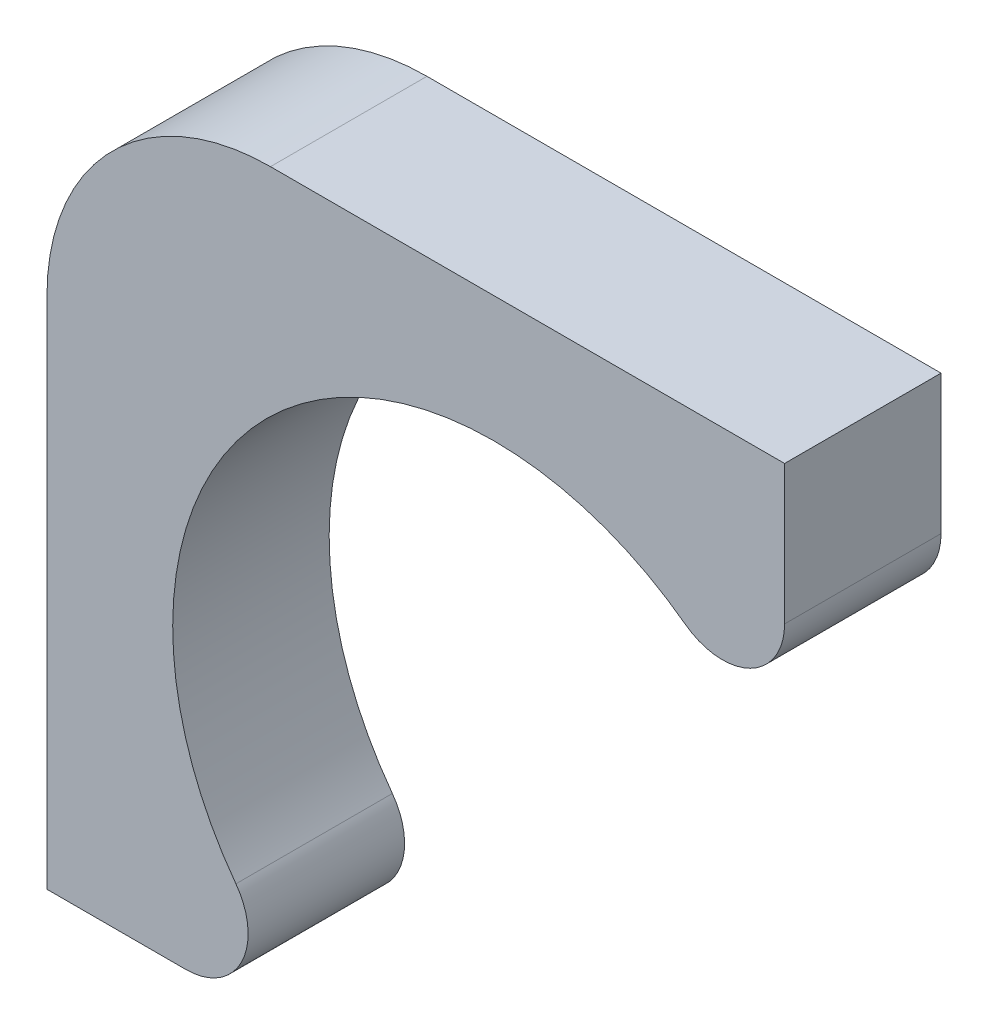
ISO-10303-21;
HEADER;
FILE_DESCRIPTION(('STEP AP214'),'2;1');
FILE_NAME('part.step','',(''),(''),'','','');
FILE_SCHEMA(('AUTOMOTIVE_DESIGN { 1 0 10303 214 1 1 1 1 }'));
ENDSEC;
DATA;
#1=APPLICATION_CONTEXT('core data for automotive mechanical design processes');
#2=APPLICATION_PROTOCOL_DEFINITION('international standard','automotive_design',2000,#1);
#3=PRODUCT_CONTEXT('',#1,'mechanical');
#4=PRODUCT('Part','Part','',(#3));
#5=PRODUCT_RELATED_PRODUCT_CATEGORY('part','',(#4));
#6=PRODUCT_DEFINITION_FORMATION('','',#4);
#7=PRODUCT_DEFINITION_CONTEXT('part definition',#1,'design');
#8=PRODUCT_DEFINITION('design','',#6,#7);
#9=PRODUCT_DEFINITION_SHAPE('','',#8);
#10=(LENGTH_UNIT() NAMED_UNIT(*) SI_UNIT(.MILLI.,.METRE.));
#11=(NAMED_UNIT(*) PLANE_ANGLE_UNIT() SI_UNIT($,.RADIAN.));
#12=(NAMED_UNIT(*) SI_UNIT($,.STERADIAN.) SOLID_ANGLE_UNIT());
#13=UNCERTAINTY_MEASURE_WITH_UNIT(LENGTH_MEASURE(1.E-05),#10,'distance_accuracy_value','');
#14=(GEOMETRIC_REPRESENTATION_CONTEXT(3) GLOBAL_UNCERTAINTY_ASSIGNED_CONTEXT((#13)) GLOBAL_UNIT_ASSIGNED_CONTEXT((#10,
#11,#12)) REPRESENTATION_CONTEXT('',''));
#15=CARTESIAN_POINT('',(0.,0.,0.));
#16=DIRECTION('',(0.,0.,1.));
#17=DIRECTION('',(1.,0.,0.));
#18=AXIS2_PLACEMENT_3D('',#15,#16,#17);
#19=CARTESIAN_POINT('',(-2.75631465594122,-2.04368534405878,1.4));
#20=DIRECTION('',(0.,0.,-1.));
#21=DIRECTION('',(-1.,0.,0.));
#22=AXIS2_PLACEMENT_3D('',#19,#20,#21);
#23=CYLINDRICAL_SURFACE('',#22,0.556314655941221);
#24=CARTESIAN_POINT('',(-2.75631465594122,-2.04368534405878,0.));
#25=DIRECTION('',(0.,0.,1.));
#26=DIRECTION('',(1.,0.,0.));
#27=AXIS2_PLACEMENT_3D('',#24,#25,#26);
#28=CIRCLE('',#27,0.556314655941221);
#29=CARTESIAN_POINT('',(-2.75631465594122,-2.6,0.));
#30=VERTEX_POINT('',#29);
#31=CARTESIAN_POINT('',(-2.30943688656187,-1.7123452534426,0.));
#32=VERTEX_POINT('',#31);
#33=EDGE_CURVE('E133',#30,#32,#28,.T.);
#34=ORIENTED_EDGE('',*,*,#33,.T.);
#35=DIRECTION('',(0.,0.,-1.));
#36=VECTOR('',#35,1.);
#37=CARTESIAN_POINT('',(-2.30943688656187,-1.7123452534426,1.4));
#38=LINE('',#37,#36);
#39=CARTESIAN_POINT('',(-2.30943688656187,-1.7123452534426,1.4));
#40=VERTEX_POINT('',#39);
#41=EDGE_CURVE('E11',#40,#32,#38,.T.);
#42=ORIENTED_EDGE('',*,*,#41,.F.);
#43=CARTESIAN_POINT('',(-2.75631465594122,-2.04368534405878,1.4));
#44=DIRECTION('',(0.,0.,1.));
#45=DIRECTION('',(1.,0.,0.));
#46=AXIS2_PLACEMENT_3D('',#43,#44,#45);
#47=CIRCLE('',#46,0.556314655941221);
#48=CARTESIAN_POINT('',(-2.75631465594122,-2.6,1.4));
#49=VERTEX_POINT('',#48);
#50=EDGE_CURVE('E147',#49,#40,#47,.T.);
#51=ORIENTED_EDGE('',*,*,#50,.F.);
#52=DIRECTION('',(0.,0.,-1.));
#53=VECTOR('',#52,1.);
#54=CARTESIAN_POINT('',(-2.75631465594122,-2.6,1.4));
#55=LINE('',#54,#53);
#56=EDGE_CURVE('E129',#49,#30,#55,.T.);
#57=ORIENTED_EDGE('',*,*,#56,.T.);
#58=EDGE_LOOP('',(#34,#42,#51,#57));
#59=FACE_BOUND('',#58,.T.);
#60=ADVANCED_FACE('F37',(#59),#23,.T.);
#61=CARTESIAN_POINT('',(0.,0.,1.4));
#62=DIRECTION('',(0.,0.,-1.));
#63=DIRECTION('',(-1.,0.,0.));
#64=AXIS2_PLACEMENT_3D('',#61,#62,#63);
#65=CYLINDRICAL_SURFACE('',#64,2.875);
#66=CARTESIAN_POINT('',(0.,0.,0.));
#67=DIRECTION('',(0.,0.,-1.));
#68=DIRECTION('',(-1.,0.,0.));
#69=AXIS2_PLACEMENT_3D('',#66,#67,#68);
#70=CIRCLE('',#69,2.875);
#71=CARTESIAN_POINT('',(1.7123452534426,2.30943688656187,0.));
#72=VERTEX_POINT('',#71);
#73=EDGE_CURVE('E136',#32,#72,#70,.T.);
#74=ORIENTED_EDGE('',*,*,#73,.T.);
#75=DIRECTION('',(0.,0.,-1.));
#76=VECTOR('',#75,1.);
#77=CARTESIAN_POINT('',(1.7123452534426,2.30943688656187,1.4));
#78=LINE('',#77,#76);
#79=CARTESIAN_POINT('',(1.7123452534426,2.30943688656187,1.4));
#80=VERTEX_POINT('',#79);
#81=EDGE_CURVE('E45',#80,#72,#78,.T.);
#82=ORIENTED_EDGE('',*,*,#81,.F.);
#83=CARTESIAN_POINT('',(0.,0.,1.4));
#84=DIRECTION('',(0.,0.,-1.));
#85=DIRECTION('',(-1.,0.,0.));
#86=AXIS2_PLACEMENT_3D('',#83,#84,#85);
#87=CIRCLE('',#86,2.875);
#88=EDGE_CURVE('E96',#40,#80,#87,.T.);
#89=ORIENTED_EDGE('',*,*,#88,.F.);
#90=ORIENTED_EDGE('',*,*,#41,.T.);
#91=EDGE_LOOP('',(#74,#82,#89,#90));
#92=FACE_BOUND('',#91,.T.);
#93=ADVANCED_FACE('F182',(#92),#65,.F.);
#94=CARTESIAN_POINT('',(2.04368534405878,2.75631465594122,1.4));
#95=DIRECTION('',(0.,0.,-1.));
#96=DIRECTION('',(-1.,0.,0.));
#97=AXIS2_PLACEMENT_3D('',#94,#95,#96);
#98=CYLINDRICAL_SURFACE('',#97,0.556314655941221);
#99=CARTESIAN_POINT('',(2.04368534405878,2.75631465594122,0.));
#100=DIRECTION('',(0.,0.,1.));
#101=DIRECTION('',(-1.,0.,0.));
#102=AXIS2_PLACEMENT_3D('',#99,#100,#101);
#103=CIRCLE('',#102,0.556314655941221);
#104=CARTESIAN_POINT('',(2.6,2.75631465594122,0.));
#105=VERTEX_POINT('',#104);
#106=EDGE_CURVE('E138',#72,#105,#103,.T.);
#107=ORIENTED_EDGE('',*,*,#106,.T.);
#108=DIRECTION('',(0.,0.,-1.));
#109=VECTOR('',#108,1.);
#110=CARTESIAN_POINT('',(2.6,2.75631465594122,1.4));
#111=LINE('',#110,#109);
#112=CARTESIAN_POINT('',(2.6,2.75631465594122,1.4));
#113=VERTEX_POINT('',#112);
#114=EDGE_CURVE('E154',#113,#105,#111,.T.);
#115=ORIENTED_EDGE('',*,*,#114,.F.);
#116=CARTESIAN_POINT('',(2.04368534405878,2.75631465594122,1.4));
#117=DIRECTION('',(0.,0.,1.));
#118=DIRECTION('',(-1.,0.,0.));
#119=AXIS2_PLACEMENT_3D('',#116,#117,#118);
#120=CIRCLE('',#119,0.556314655941221);
#121=EDGE_CURVE('E162',#80,#113,#120,.T.);
#122=ORIENTED_EDGE('',*,*,#121,.F.);
#123=ORIENTED_EDGE('',*,*,#81,.T.);
#124=EDGE_LOOP('',(#107,#115,#122,#123));
#125=FACE_BOUND('',#124,.T.);
#126=ADVANCED_FACE('F160',(#125),#98,.T.);
#127=CARTESIAN_POINT('',(2.6,4.,1.4));
#128=DIRECTION('',(-1.,0.,0.));
#129=DIRECTION('',(0.,-1.,0.));
#130=AXIS2_PLACEMENT_3D('',#127,#128,#129);
#131=PLANE('',#130);
#132=DIRECTION('',(0.,1.,0.));
#133=VECTOR('',#132,1.);
#134=CARTESIAN_POINT('',(2.6,4.,0.));
#135=LINE('',#134,#133);
#136=CARTESIAN_POINT('',(2.6,4.,0.));
#137=VERTEX_POINT('',#136);
#138=EDGE_CURVE('E140',#105,#137,#135,.T.);
#139=ORIENTED_EDGE('',*,*,#138,.T.);
#140=DIRECTION('',(0.,0.,-1.));
#141=VECTOR('',#140,1.);
#142=CARTESIAN_POINT('',(2.6,4.,1.4));
#143=LINE('',#142,#141);
#144=CARTESIAN_POINT('',(2.6,4.,1.4));
#145=VERTEX_POINT('',#144);
#146=EDGE_CURVE('E151',#145,#137,#143,.T.);
#147=ORIENTED_EDGE('',*,*,#146,.F.);
#148=DIRECTION('',(0.,1.,0.));
#149=VECTOR('',#148,1.);
#150=CARTESIAN_POINT('',(2.6,4.,1.4));
#151=LINE('',#150,#149);
#152=EDGE_CURVE('E174',#113,#145,#151,.T.);
#153=ORIENTED_EDGE('',*,*,#152,.F.);
#154=ORIENTED_EDGE('',*,*,#114,.T.);
#155=EDGE_LOOP('',(#139,#147,#153,#154));
#156=FACE_BOUND('',#155,.T.);
#157=ADVANCED_FACE('F170',(#156),#131,.F.);
#158=CARTESIAN_POINT('',(2.6,4.,1.4));
#159=DIRECTION('',(0.,-1.,0.));
#160=DIRECTION('',(1.,0.,0.));
#161=AXIS2_PLACEMENT_3D('',#158,#159,#160);
#162=PLANE('',#161);
#163=DIRECTION('',(-1.,0.,0.));
#164=VECTOR('',#163,1.);
#165=CARTESIAN_POINT('',(2.6,4.,0.));
#166=LINE('',#165,#164);
#167=CARTESIAN_POINT('',(-1.99999999999999,4.,0.));
#168=VERTEX_POINT('',#167);
#169=EDGE_CURVE('E142',#137,#168,#166,.T.);
#170=ORIENTED_EDGE('',*,*,#169,.T.);
#171=DIRECTION('',(0.,0.,-1.));
#172=VECTOR('',#171,1.);
#173=CARTESIAN_POINT('',(-1.99999999999999,4.,1.4));
#174=LINE('',#173,#172);
#175=CARTESIAN_POINT('',(-1.99999999999999,4.,1.4));
#176=VERTEX_POINT('',#175);
#177=EDGE_CURVE('E124',#176,#168,#174,.T.);
#178=ORIENTED_EDGE('',*,*,#177,.F.);
#179=DIRECTION('',(-1.,0.,0.));
#180=VECTOR('',#179,1.);
#181=CARTESIAN_POINT('',(2.6,4.,1.4));
#182=LINE('',#181,#180);
#183=EDGE_CURVE('E115',#145,#176,#182,.T.);
#184=ORIENTED_EDGE('',*,*,#183,.F.);
#185=ORIENTED_EDGE('',*,*,#146,.T.);
#186=EDGE_LOOP('',(#170,#178,#184,#185));
#187=FACE_BOUND('',#186,.T.);
#188=ADVANCED_FACE('F173',(#187),#162,.F.);
#189=CARTESIAN_POINT('',(-2.,2.,1.4));
#190=DIRECTION('',(0.,0.,-1.));
#191=DIRECTION('',(-1.,0.,0.));
#192=AXIS2_PLACEMENT_3D('',#189,#190,#191);
#193=CYLINDRICAL_SURFACE('',#192,2.);
#194=CARTESIAN_POINT('',(-2.,2.,0.));
#195=DIRECTION('',(0.,0.,1.));
#196=DIRECTION('',(1.,0.,0.));
#197=AXIS2_PLACEMENT_3D('',#194,#195,#196);
#198=CIRCLE('',#197,2.);
#199=CARTESIAN_POINT('',(-4.,1.99999999999999,0.));
#200=VERTEX_POINT('',#199);
#201=EDGE_CURVE('E123',#168,#200,#198,.T.);
#202=ORIENTED_EDGE('',*,*,#201,.T.);
#203=DIRECTION('',(0.,0.,-1.));
#204=VECTOR('',#203,1.);
#205=CARTESIAN_POINT('',(-4.,1.99999999999999,1.4));
#206=LINE('',#205,#204);
#207=CARTESIAN_POINT('',(-4.,1.99999999999999,1.4));
#208=VERTEX_POINT('',#207);
#209=EDGE_CURVE('E120',#208,#200,#206,.T.);
#210=ORIENTED_EDGE('',*,*,#209,.F.);
#211=CARTESIAN_POINT('',(-2.,2.,1.4));
#212=DIRECTION('',(0.,0.,1.));
#213=DIRECTION('',(1.,0.,0.));
#214=AXIS2_PLACEMENT_3D('',#211,#212,#213);
#215=CIRCLE('',#214,2.);
#216=EDGE_CURVE('E109',#176,#208,#215,.T.);
#217=ORIENTED_EDGE('',*,*,#216,.F.);
#218=ORIENTED_EDGE('',*,*,#177,.T.);
#219=EDGE_LOOP('',(#202,#210,#217,#218));
#220=FACE_BOUND('',#219,.T.);
#221=ADVANCED_FACE('F121',(#220),#193,.T.);
#222=CARTESIAN_POINT('',(-4.,1.99999999999998,1.4));
#223=DIRECTION('',(1.,0.,0.));
#224=DIRECTION('',(0.,0.,-1.));
#225=AXIS2_PLACEMENT_3D('',#222,#223,#224);
#226=PLANE('',#225);
#227=DIRECTION('',(0.,-1.,0.));
#228=VECTOR('',#227,1.);
#229=CARTESIAN_POINT('',(-4.,1.99999999999998,0.));
#230=LINE('',#229,#228);
#231=CARTESIAN_POINT('',(-4.,-2.6,0.));
#232=VERTEX_POINT('',#231);
#233=EDGE_CURVE('E82',#200,#232,#230,.T.);
#234=ORIENTED_EDGE('',*,*,#233,.T.);
#235=DIRECTION('',(0.,0.,-1.));
#236=VECTOR('',#235,1.);
#237=CARTESIAN_POINT('',(-4.,-2.6,1.4));
#238=LINE('',#237,#236);
#239=CARTESIAN_POINT('',(-4.,-2.6,1.4));
#240=VERTEX_POINT('',#239);
#241=EDGE_CURVE('E125',#240,#232,#238,.T.);
#242=ORIENTED_EDGE('',*,*,#241,.F.);
#243=DIRECTION('',(0.,-1.,0.));
#244=VECTOR('',#243,1.);
#245=CARTESIAN_POINT('',(-4.,1.99999999999998,1.4));
#246=LINE('',#245,#244);
#247=EDGE_CURVE('E113',#208,#240,#246,.T.);
#248=ORIENTED_EDGE('',*,*,#247,.F.);
#249=ORIENTED_EDGE('',*,*,#209,.T.);
#250=EDGE_LOOP('',(#234,#242,#248,#249));
#251=FACE_BOUND('',#250,.T.);
#252=ADVANCED_FACE('F127',(#251),#226,.F.);
#253=CARTESIAN_POINT('',(-4.,-2.6,1.4));
#254=DIRECTION('',(0.,1.,0.));
#255=DIRECTION('',(0.,0.,1.));
#256=AXIS2_PLACEMENT_3D('',#253,#254,#255);
#257=PLANE('',#256);
#258=DIRECTION('',(1.,0.,0.));
#259=VECTOR('',#258,1.);
#260=CARTESIAN_POINT('',(-4.,-2.6,0.));
#261=LINE('',#260,#259);
#262=EDGE_CURVE('E88',#232,#30,#261,.T.);
#263=ORIENTED_EDGE('',*,*,#262,.T.);
#264=ORIENTED_EDGE('',*,*,#56,.F.);
#265=DIRECTION('',(1.,0.,0.));
#266=VECTOR('',#265,1.);
#267=CARTESIAN_POINT('',(-4.,-2.6,1.4));
#268=LINE('',#267,#266);
#269=EDGE_CURVE('E53',#240,#49,#268,.T.);
#270=ORIENTED_EDGE('',*,*,#269,.F.);
#271=ORIENTED_EDGE('',*,*,#241,.T.);
#272=EDGE_LOOP('',(#263,#264,#270,#271));
#273=FACE_BOUND('',#272,.T.);
#274=ADVANCED_FACE('F198',(#273),#257,.F.);
#275=CARTESIAN_POINT('',(-2.75631465594122,-2.04368534405878,1.4));
#276=DIRECTION('',(0.,0.,1.));
#277=DIRECTION('',(1.,0.,0.));
#278=AXIS2_PLACEMENT_3D('',#275,#276,#277);
#279=PLANE('',#278);
#280=ORIENTED_EDGE('',*,*,#50,.T.);
#281=ORIENTED_EDGE('',*,*,#88,.T.);
#282=ORIENTED_EDGE('',*,*,#121,.T.);
#283=ORIENTED_EDGE('',*,*,#152,.T.);
#284=ORIENTED_EDGE('',*,*,#183,.T.);
#285=ORIENTED_EDGE('',*,*,#216,.T.);
#286=ORIENTED_EDGE('',*,*,#247,.T.);
#287=ORIENTED_EDGE('',*,*,#269,.T.);
#288=EDGE_LOOP('',(#280,#281,#282,#283,#284,#285,#286,#287));
#289=FACE_BOUND('',#288,.T.);
#290=ADVANCED_FACE('F111',(#289),#279,.T.);
#291=CARTESIAN_POINT('',(-2.75631465594122,-2.04368534405878,0.));
#292=DIRECTION('',(0.,0.,1.));
#293=DIRECTION('',(1.,0.,0.));
#294=AXIS2_PLACEMENT_3D('',#291,#292,#293);
#295=PLANE('',#294);
#296=ORIENTED_EDGE('',*,*,#33,.F.);
#297=ORIENTED_EDGE('',*,*,#262,.F.);
#298=ORIENTED_EDGE('',*,*,#233,.F.);
#299=ORIENTED_EDGE('',*,*,#201,.F.);
#300=ORIENTED_EDGE('',*,*,#169,.F.);
#301=ORIENTED_EDGE('',*,*,#138,.F.);
#302=ORIENTED_EDGE('',*,*,#106,.F.);
#303=ORIENTED_EDGE('',*,*,#73,.F.);
#304=EDGE_LOOP('',(#296,#297,#298,#299,#300,#301,#302,#303));
#305=FACE_BOUND('',#304,.T.);
#306=ADVANCED_FACE('F166',(#305),#295,.F.);
#307=CLOSED_SHELL('',(#60,#93,#126,#157,#188,#221,#252,#274,#290,#306));
#308=MANIFOLD_SOLID_BREP('B2',#307);
#309=ADVANCED_BREP_SHAPE_REPRESENTATION('',(#18,#308),#14);
#310=SHAPE_DEFINITION_REPRESENTATION(#9,#309);
ENDSEC;
END-ISO-10303-21;
